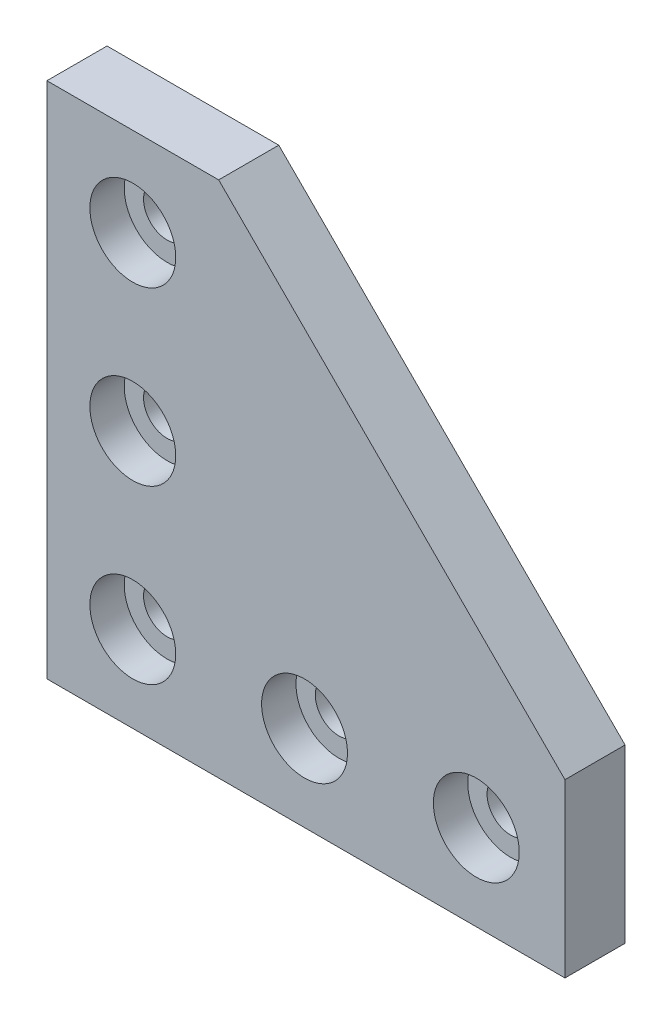
ISO-10303-21;
HEADER;
FILE_DESCRIPTION(('STEP AP214'),'2;1');
FILE_NAME('part.step','',(''),(''),'','','');
FILE_SCHEMA(('AUTOMOTIVE_DESIGN { 1 0 10303 214 1 1 1 1 }'));
ENDSEC;
DATA;
#1=APPLICATION_CONTEXT('core data for automotive mechanical design processes');
#2=APPLICATION_PROTOCOL_DEFINITION('international standard','automotive_design',2000,#1);
#3=PRODUCT_CONTEXT('',#1,'mechanical');
#4=PRODUCT('Part','Part','',(#3));
#5=PRODUCT_RELATED_PRODUCT_CATEGORY('part','',(#4));
#6=PRODUCT_DEFINITION_FORMATION('','',#4);
#7=PRODUCT_DEFINITION_CONTEXT('part definition',#1,'design');
#8=PRODUCT_DEFINITION('design','',#6,#7);
#9=PRODUCT_DEFINITION_SHAPE('','',#8);
#10=(LENGTH_UNIT() NAMED_UNIT(*) SI_UNIT(.MILLI.,.METRE.));
#11=(NAMED_UNIT(*) PLANE_ANGLE_UNIT() SI_UNIT($,.RADIAN.));
#12=(NAMED_UNIT(*) SI_UNIT($,.STERADIAN.) SOLID_ANGLE_UNIT());
#13=UNCERTAINTY_MEASURE_WITH_UNIT(LENGTH_MEASURE(1.E-05),#10,'distance_accuracy_value','');
#14=(GEOMETRIC_REPRESENTATION_CONTEXT(3) GLOBAL_UNCERTAINTY_ASSIGNED_CONTEXT((#13)) GLOBAL_UNIT_ASSIGNED_CONTEXT((#10,
#11,#12)) REPRESENTATION_CONTEXT('',''));
#15=CARTESIAN_POINT('',(0.,0.,0.));
#16=DIRECTION('',(0.,0.,1.));
#17=DIRECTION('',(1.,0.,0.));
#18=AXIS2_PLACEMENT_3D('',#15,#16,#17);
#19=CARTESIAN_POINT('',(30.1625,30.1625,0.));
#20=DIRECTION('',(0.,0.,1.));
#21=DIRECTION('',(1.,0.,0.));
#22=AXIS2_PLACEMENT_3D('',#19,#20,#21);
#23=PLANE('',#22);
#24=CARTESIAN_POINT('',(10.,10.,0.));
#25=DIRECTION('',(0.,0.,-1.));
#26=DIRECTION('',(-1.,0.,0.));
#27=AXIS2_PLACEMENT_3D('',#24,#25,#26);
#28=CIRCLE('',#27,2.75);
#29=CARTESIAN_POINT('',(12.75,10.,0.));
#30=VERTEX_POINT('',#29);
#31=EDGE_CURVE('E414',#30,#30,#28,.T.);
#32=ORIENTED_EDGE('',*,*,#31,.F.);
#33=EDGE_LOOP('',(#32));
#34=FACE_BOUND('',#33,.T.);
#35=CARTESIAN_POINT('',(10.,30.,0.));
#36=DIRECTION('',(0.,0.,-1.));
#37=DIRECTION('',(-1.,0.,0.));
#38=AXIS2_PLACEMENT_3D('',#35,#36,#37);
#39=CIRCLE('',#38,2.75);
#40=CARTESIAN_POINT('',(12.75,30.,0.));
#41=VERTEX_POINT('',#40);
#42=EDGE_CURVE('E227',#41,#41,#39,.T.);
#43=ORIENTED_EDGE('',*,*,#42,.F.);
#44=EDGE_LOOP('',(#43));
#45=FACE_BOUND('',#44,.T.);
#46=CARTESIAN_POINT('',(10.,50.,0.));
#47=DIRECTION('',(0.,0.,-1.));
#48=DIRECTION('',(-1.,0.,0.));
#49=AXIS2_PLACEMENT_3D('',#46,#47,#48);
#50=CIRCLE('',#49,2.75);
#51=CARTESIAN_POINT('',(12.75,50.,0.));
#52=VERTEX_POINT('',#51);
#53=EDGE_CURVE('E226',#52,#52,#50,.T.);
#54=ORIENTED_EDGE('',*,*,#53,.F.);
#55=EDGE_LOOP('',(#54));
#56=FACE_BOUND('',#55,.T.);
#57=CARTESIAN_POINT('',(30.,10.,0.));
#58=DIRECTION('',(0.,0.,-1.));
#59=DIRECTION('',(-1.,0.,0.));
#60=AXIS2_PLACEMENT_3D('',#57,#58,#59);
#61=CIRCLE('',#60,2.75);
#62=CARTESIAN_POINT('',(32.75,10.,0.));
#63=VERTEX_POINT('',#62);
#64=EDGE_CURVE('E217',#63,#63,#61,.T.);
#65=ORIENTED_EDGE('',*,*,#64,.F.);
#66=EDGE_LOOP('',(#65));
#67=FACE_BOUND('',#66,.T.);
#68=CARTESIAN_POINT('',(50.,10.,0.));
#69=DIRECTION('',(0.,0.,-1.));
#70=DIRECTION('',(-1.,0.,0.));
#71=AXIS2_PLACEMENT_3D('',#68,#69,#70);
#72=CIRCLE('',#71,2.75);
#73=CARTESIAN_POINT('',(52.75,10.,0.));
#74=VERTEX_POINT('',#73);
#75=EDGE_CURVE('E187',#74,#74,#72,.T.);
#76=ORIENTED_EDGE('',*,*,#75,.F.);
#77=EDGE_LOOP('',(#76));
#78=FACE_BOUND('',#77,.T.);
#79=DIRECTION('',(1.,0.,0.));
#80=VECTOR('',#79,1.);
#81=CARTESIAN_POINT('',(0.,0.,0.));
#82=LINE('',#81,#80);
#83=CARTESIAN_POINT('',(0.,0.,0.));
#84=VERTEX_POINT('',#83);
#85=CARTESIAN_POINT('',(60.325,0.,0.));
#86=VERTEX_POINT('',#85);
#87=EDGE_CURVE('E27',#84,#86,#82,.T.);
#88=ORIENTED_EDGE('',*,*,#87,.F.);
#89=DIRECTION('',(0.,-1.,0.));
#90=VECTOR('',#89,1.);
#91=CARTESIAN_POINT('',(0.,60.325,0.));
#92=LINE('',#91,#90);
#93=CARTESIAN_POINT('',(0.,60.325,0.));
#94=VERTEX_POINT('',#93);
#95=EDGE_CURVE('E20',#94,#84,#92,.T.);
#96=ORIENTED_EDGE('',*,*,#95,.F.);
#97=DIRECTION('',(-1.,0.,0.));
#98=VECTOR('',#97,1.);
#99=CARTESIAN_POINT('',(20.,60.325,0.));
#100=LINE('',#99,#98);
#101=CARTESIAN_POINT('',(20.,60.325,0.));
#102=VERTEX_POINT('',#101);
#103=EDGE_CURVE('E194',#102,#94,#100,.T.);
#104=ORIENTED_EDGE('',*,*,#103,.F.);
#105=DIRECTION('',(-0.707106781186548,0.707106781186548,0.));
#106=VECTOR('',#105,1.);
#107=CARTESIAN_POINT('',(60.325,20.,0.));
#108=LINE('',#107,#106);
#109=CARTESIAN_POINT('',(60.325,20.,0.));
#110=VERTEX_POINT('',#109);
#111=EDGE_CURVE('E270',#110,#102,#108,.T.);
#112=ORIENTED_EDGE('',*,*,#111,.F.);
#113=DIRECTION('',(0.,1.,0.));
#114=VECTOR('',#113,1.);
#115=CARTESIAN_POINT('',(60.325,0.,0.));
#116=LINE('',#115,#114);
#117=EDGE_CURVE('E260',#86,#110,#116,.T.);
#118=ORIENTED_EDGE('',*,*,#117,.F.);
#119=EDGE_LOOP('',(#88,#96,#104,#112,#118));
#120=FACE_BOUND('',#119,.T.);
#121=ADVANCED_FACE('F16',(#34,#45,#56,#67,#78,#120),#23,.F.);
#122=CARTESIAN_POINT('',(30.1625,30.1625,7.));
#123=DIRECTION('',(0.,0.,1.));
#124=DIRECTION('',(1.,0.,0.));
#125=AXIS2_PLACEMENT_3D('',#122,#123,#124);
#126=PLANE('',#125);
#127=DIRECTION('',(-1.,0.,0.));
#128=VECTOR('',#127,1.);
#129=CARTESIAN_POINT('',(0.,0.,7.));
#130=LINE('',#129,#128);
#131=CARTESIAN_POINT('',(60.325,0.,7.));
#132=VERTEX_POINT('',#131);
#133=CARTESIAN_POINT('',(0.,0.,7.));
#134=VERTEX_POINT('',#133);
#135=EDGE_CURVE('E11',#132,#134,#130,.T.);
#136=ORIENTED_EDGE('',*,*,#135,.F.);
#137=DIRECTION('',(0.,-1.,0.));
#138=VECTOR('',#137,1.);
#139=CARTESIAN_POINT('',(60.325,0.,7.));
#140=LINE('',#139,#138);
#141=CARTESIAN_POINT('',(60.325,20.,7.));
#142=VERTEX_POINT('',#141);
#143=EDGE_CURVE('E212',#142,#132,#140,.T.);
#144=ORIENTED_EDGE('',*,*,#143,.F.);
#145=DIRECTION('',(0.707106781186548,-0.707106781186548,0.));
#146=VECTOR('',#145,1.);
#147=CARTESIAN_POINT('',(60.325,20.,7.));
#148=LINE('',#147,#146);
#149=CARTESIAN_POINT('',(20.,60.325,7.));
#150=VERTEX_POINT('',#149);
#151=EDGE_CURVE('E261',#150,#142,#148,.T.);
#152=ORIENTED_EDGE('',*,*,#151,.F.);
#153=DIRECTION('',(1.,0.,0.));
#154=VECTOR('',#153,1.);
#155=CARTESIAN_POINT('',(20.,60.325,7.));
#156=LINE('',#155,#154);
#157=CARTESIAN_POINT('',(0.,60.325,7.));
#158=VERTEX_POINT('',#157);
#159=EDGE_CURVE('E174',#158,#150,#156,.T.);
#160=ORIENTED_EDGE('',*,*,#159,.F.);
#161=DIRECTION('',(0.,1.,0.));
#162=VECTOR('',#161,1.);
#163=CARTESIAN_POINT('',(0.,60.325,7.));
#164=LINE('',#163,#162);
#165=EDGE_CURVE('E170',#134,#158,#164,.T.);
#166=ORIENTED_EDGE('',*,*,#165,.F.);
#167=EDGE_LOOP('',(#136,#144,#152,#160,#166));
#168=FACE_BOUND('',#167,.T.);
#169=CARTESIAN_POINT('',(10.,50.,7.));
#170=DIRECTION('',(0.,0.,1.));
#171=DIRECTION('',(1.,0.,0.));
#172=AXIS2_PLACEMENT_3D('',#169,#170,#171);
#173=CIRCLE('',#172,5.);
#174=CARTESIAN_POINT('',(15.,50.,7.));
#175=VERTEX_POINT('',#174);
#176=EDGE_CURVE('E437',#175,#175,#173,.T.);
#177=ORIENTED_EDGE('',*,*,#176,.F.);
#178=EDGE_LOOP('',(#177));
#179=FACE_BOUND('',#178,.T.);
#180=CARTESIAN_POINT('',(50.,10.,7.));
#181=DIRECTION('',(0.,0.,1.));
#182=DIRECTION('',(1.,0.,0.));
#183=AXIS2_PLACEMENT_3D('',#180,#181,#182);
#184=CIRCLE('',#183,5.);
#185=CARTESIAN_POINT('',(55.,10.,7.));
#186=VERTEX_POINT('',#185);
#187=EDGE_CURVE('E388',#186,#186,#184,.T.);
#188=ORIENTED_EDGE('',*,*,#187,.F.);
#189=EDGE_LOOP('',(#188));
#190=FACE_BOUND('',#189,.T.);
#191=CARTESIAN_POINT('',(10.,30.,7.));
#192=DIRECTION('',(0.,0.,1.));
#193=DIRECTION('',(1.,0.,0.));
#194=AXIS2_PLACEMENT_3D('',#191,#192,#193);
#195=CIRCLE('',#194,5.);
#196=CARTESIAN_POINT('',(15.,30.,7.));
#197=VERTEX_POINT('',#196);
#198=EDGE_CURVE('E244',#197,#197,#195,.T.);
#199=ORIENTED_EDGE('',*,*,#198,.F.);
#200=EDGE_LOOP('',(#199));
#201=FACE_BOUND('',#200,.T.);
#202=CARTESIAN_POINT('',(30.,10.,7.));
#203=DIRECTION('',(0.,0.,1.));
#204=DIRECTION('',(1.,0.,0.));
#205=AXIS2_PLACEMENT_3D('',#202,#203,#204);
#206=CIRCLE('',#205,5.);
#207=CARTESIAN_POINT('',(35.,10.,7.));
#208=VERTEX_POINT('',#207);
#209=EDGE_CURVE('E370',#208,#208,#206,.T.);
#210=ORIENTED_EDGE('',*,*,#209,.F.);
#211=EDGE_LOOP('',(#210));
#212=FACE_BOUND('',#211,.T.);
#213=CARTESIAN_POINT('',(10.,10.,7.));
#214=DIRECTION('',(0.,0.,1.));
#215=DIRECTION('',(1.,0.,0.));
#216=AXIS2_PLACEMENT_3D('',#213,#214,#215);
#217=CIRCLE('',#216,5.);
#218=CARTESIAN_POINT('',(15.,10.,7.));
#219=VERTEX_POINT('',#218);
#220=EDGE_CURVE('E442',#219,#219,#217,.T.);
#221=ORIENTED_EDGE('',*,*,#220,.F.);
#222=EDGE_LOOP('',(#221));
#223=FACE_BOUND('',#222,.T.);
#224=ADVANCED_FACE('F171',(#168,#179,#190,#201,#212,#223),#126,.T.);
#225=CARTESIAN_POINT('',(0.,0.,0.));
#226=DIRECTION('',(0.,-1.,0.));
#227=DIRECTION('',(0.,0.,-1.));
#228=AXIS2_PLACEMENT_3D('',#225,#226,#227);
#229=PLANE('',#228);
#230=ORIENTED_EDGE('',*,*,#87,.T.);
#231=DIRECTION('',(0.,0.,-1.));
#232=VECTOR('',#231,1.);
#233=CARTESIAN_POINT('',(60.325,0.,0.));
#234=LINE('',#233,#232);
#235=EDGE_CURVE('E167',#132,#86,#234,.T.);
#236=ORIENTED_EDGE('',*,*,#235,.F.);
#237=ORIENTED_EDGE('',*,*,#135,.T.);
#238=DIRECTION('',(0.,0.,1.));
#239=VECTOR('',#238,1.);
#240=CARTESIAN_POINT('',(0.,0.,0.));
#241=LINE('',#240,#239);
#242=EDGE_CURVE('E164',#84,#134,#241,.T.);
#243=ORIENTED_EDGE('',*,*,#242,.F.);
#244=EDGE_LOOP('',(#230,#236,#237,#243));
#245=FACE_BOUND('',#244,.T.);
#246=ADVANCED_FACE('F162',(#245),#229,.T.);
#247=CARTESIAN_POINT('',(60.325,0.,0.));
#248=DIRECTION('',(1.,0.,0.));
#249=DIRECTION('',(0.,1.,0.));
#250=AXIS2_PLACEMENT_3D('',#247,#248,#249);
#251=PLANE('',#250);
#252=ORIENTED_EDGE('',*,*,#117,.T.);
#253=DIRECTION('',(0.,0.,-1.));
#254=VECTOR('',#253,1.);
#255=CARTESIAN_POINT('',(60.325,20.,0.));
#256=LINE('',#255,#254);
#257=EDGE_CURVE('E254',#142,#110,#256,.T.);
#258=ORIENTED_EDGE('',*,*,#257,.F.);
#259=ORIENTED_EDGE('',*,*,#143,.T.);
#260=ORIENTED_EDGE('',*,*,#235,.T.);
#261=EDGE_LOOP('',(#252,#258,#259,#260));
#262=FACE_BOUND('',#261,.T.);
#263=ADVANCED_FACE('F280',(#262),#251,.T.);
#264=CARTESIAN_POINT('',(60.325,20.,0.));
#265=DIRECTION('',(0.707106781186548,0.707106781186548,0.));
#266=DIRECTION('',(0.,0.,-1.));
#267=AXIS2_PLACEMENT_3D('',#264,#265,#266);
#268=PLANE('',#267);
#269=ORIENTED_EDGE('',*,*,#111,.T.);
#270=DIRECTION('',(0.,0.,-1.));
#271=VECTOR('',#270,1.);
#272=CARTESIAN_POINT('',(20.,60.325,0.));
#273=LINE('',#272,#271);
#274=EDGE_CURVE('E205',#150,#102,#273,.T.);
#275=ORIENTED_EDGE('',*,*,#274,.F.);
#276=ORIENTED_EDGE('',*,*,#151,.T.);
#277=ORIENTED_EDGE('',*,*,#257,.T.);
#278=EDGE_LOOP('',(#269,#275,#276,#277));
#279=FACE_BOUND('',#278,.T.);
#280=ADVANCED_FACE('F285',(#279),#268,.T.);
#281=CARTESIAN_POINT('',(20.,60.325,0.));
#282=DIRECTION('',(0.,1.,0.));
#283=DIRECTION('',(1.,0.,0.));
#284=AXIS2_PLACEMENT_3D('',#281,#282,#283);
#285=PLANE('',#284);
#286=ORIENTED_EDGE('',*,*,#103,.T.);
#287=DIRECTION('',(0.,0.,-1.));
#288=VECTOR('',#287,1.);
#289=CARTESIAN_POINT('',(0.,60.325,0.));
#290=LINE('',#289,#288);
#291=EDGE_CURVE('E179',#158,#94,#290,.T.);
#292=ORIENTED_EDGE('',*,*,#291,.F.);
#293=ORIENTED_EDGE('',*,*,#159,.T.);
#294=ORIENTED_EDGE('',*,*,#274,.T.);
#295=EDGE_LOOP('',(#286,#292,#293,#294));
#296=FACE_BOUND('',#295,.T.);
#297=ADVANCED_FACE('F288',(#296),#285,.T.);
#298=CARTESIAN_POINT('',(0.,60.325,0.));
#299=DIRECTION('',(-1.,0.,0.));
#300=DIRECTION('',(0.,0.,1.));
#301=AXIS2_PLACEMENT_3D('',#298,#299,#300);
#302=PLANE('',#301);
#303=ORIENTED_EDGE('',*,*,#95,.T.);
#304=ORIENTED_EDGE('',*,*,#242,.T.);
#305=ORIENTED_EDGE('',*,*,#165,.T.);
#306=ORIENTED_EDGE('',*,*,#291,.T.);
#307=EDGE_LOOP('',(#303,#304,#305,#306));
#308=FACE_BOUND('',#307,.T.);
#309=ADVANCED_FACE('F18',(#308),#302,.T.);
#310=CARTESIAN_POINT('',(50.,10.,0.));
#311=DIRECTION('',(0.,0.,1.));
#312=DIRECTION('',(-1.,0.,0.));
#313=AXIS2_PLACEMENT_3D('',#310,#311,#312);
#314=CYLINDRICAL_SURFACE('',#313,2.75);
#315=CARTESIAN_POINT('',(52.75,10.,0.));
#316=CARTESIAN_POINT('',(52.75,10.,3.));
#317=(BOUNDED_CURVE() B_SPLINE_CURVE(1,(#315,#316),.UNSPECIFIED.,.F.,
.F.) B_SPLINE_CURVE_WITH_KNOTS((2,2),(0.,3.),
.UNSPECIFIED.) CURVE() GEOMETRIC_REPRESENTATION_ITEM() RATIONAL_B_SPLINE_CURVE((1.,1.)) REPRESENTATION_ITEM(''));
#318=CARTESIAN_POINT('',(52.75,10.,3.));
#319=VERTEX_POINT('',#318);
#320=EDGE_CURVE('E60',#74,#319,#317,.T.);
#321=ORIENTED_EDGE('',*,*,#320,.F.);
#322=ORIENTED_EDGE('',*,*,#75,.T.);
#323=ORIENTED_EDGE('',*,*,#320,.T.);
#324=CARTESIAN_POINT('',(50.,10.,3.));
#325=DIRECTION('',(0.,0.,-1.));
#326=DIRECTION('',(-1.,0.,0.));
#327=AXIS2_PLACEMENT_3D('',#324,#325,#326);
#328=CIRCLE('',#327,2.75);
#329=EDGE_CURVE('E396',#319,#319,#328,.T.);
#330=ORIENTED_EDGE('',*,*,#329,.F.);
#331=EDGE_LOOP('',(#321,#322,#323,#330));
#332=FACE_BOUND('',#331,.T.);
#333=ADVANCED_FACE('F296',(#332),#314,.F.);
#334=CARTESIAN_POINT('',(30.,10.,0.));
#335=DIRECTION('',(0.,0.,1.));
#336=DIRECTION('',(-1.,0.,0.));
#337=AXIS2_PLACEMENT_3D('',#334,#335,#336);
#338=CYLINDRICAL_SURFACE('',#337,2.75);
#339=CARTESIAN_POINT('',(32.75,10.,0.));
#340=CARTESIAN_POINT('',(32.75,10.,3.));
#341=(BOUNDED_CURVE() B_SPLINE_CURVE(1,(#339,#340),.UNSPECIFIED.,.F.,
.F.) B_SPLINE_CURVE_WITH_KNOTS((2,2),(0.,3.),
.UNSPECIFIED.) CURVE() GEOMETRIC_REPRESENTATION_ITEM() RATIONAL_B_SPLINE_CURVE((1.,1.)) REPRESENTATION_ITEM(''));
#342=CARTESIAN_POINT('',(32.75,10.,3.));
#343=VERTEX_POINT('',#342);
#344=EDGE_CURVE('E250',#63,#343,#341,.T.);
#345=ORIENTED_EDGE('',*,*,#344,.F.);
#346=ORIENTED_EDGE('',*,*,#64,.T.);
#347=ORIENTED_EDGE('',*,*,#344,.T.);
#348=CARTESIAN_POINT('',(30.,10.,3.));
#349=DIRECTION('',(0.,0.,-1.));
#350=DIRECTION('',(-1.,0.,0.));
#351=AXIS2_PLACEMENT_3D('',#348,#349,#350);
#352=CIRCLE('',#351,2.75);
#353=EDGE_CURVE('E233',#343,#343,#352,.T.);
#354=ORIENTED_EDGE('',*,*,#353,.F.);
#355=EDGE_LOOP('',(#345,#346,#347,#354));
#356=FACE_BOUND('',#355,.T.);
#357=ADVANCED_FACE('F334',(#356),#338,.F.);
#358=CARTESIAN_POINT('',(10.,50.,0.));
#359=DIRECTION('',(0.,0.,1.));
#360=DIRECTION('',(-1.,0.,0.));
#361=AXIS2_PLACEMENT_3D('',#358,#359,#360);
#362=CYLINDRICAL_SURFACE('',#361,2.75);
#363=CARTESIAN_POINT('',(12.75,50.,0.));
#364=CARTESIAN_POINT('',(12.75,50.,3.));
#365=(BOUNDED_CURVE() B_SPLINE_CURVE(1,(#363,#364),.UNSPECIFIED.,.F.,
.F.) B_SPLINE_CURVE_WITH_KNOTS((2,2),(0.,3.),
.UNSPECIFIED.) CURVE() GEOMETRIC_REPRESENTATION_ITEM() RATIONAL_B_SPLINE_CURVE((1.,1.)) REPRESENTATION_ITEM(''));
#366=CARTESIAN_POINT('',(12.75,50.,3.));
#367=VERTEX_POINT('',#366);
#368=EDGE_CURVE('E218',#52,#367,#365,.T.);
#369=ORIENTED_EDGE('',*,*,#368,.F.);
#370=ORIENTED_EDGE('',*,*,#53,.T.);
#371=ORIENTED_EDGE('',*,*,#368,.T.);
#372=CARTESIAN_POINT('',(10.,50.,3.));
#373=DIRECTION('',(0.,0.,-1.));
#374=DIRECTION('',(-1.,0.,0.));
#375=AXIS2_PLACEMENT_3D('',#372,#373,#374);
#376=CIRCLE('',#375,2.75);
#377=EDGE_CURVE('E209',#367,#367,#376,.T.);
#378=ORIENTED_EDGE('',*,*,#377,.F.);
#379=EDGE_LOOP('',(#369,#370,#371,#378));
#380=FACE_BOUND('',#379,.T.);
#381=ADVANCED_FACE('F328',(#380),#362,.F.);
#382=CARTESIAN_POINT('',(10.,30.,0.));
#383=DIRECTION('',(0.,0.,1.));
#384=DIRECTION('',(-1.,0.,0.));
#385=AXIS2_PLACEMENT_3D('',#382,#383,#384);
#386=CYLINDRICAL_SURFACE('',#385,2.75);
#387=CARTESIAN_POINT('',(12.75,30.,0.));
#388=CARTESIAN_POINT('',(12.75,30.,3.));
#389=(BOUNDED_CURVE() B_SPLINE_CURVE(1,(#387,#388),.UNSPECIFIED.,.F.,
.F.) B_SPLINE_CURVE_WITH_KNOTS((2,2),(0.,3.),
.UNSPECIFIED.) CURVE() GEOMETRIC_REPRESENTATION_ITEM() RATIONAL_B_SPLINE_CURVE((1.,1.)) REPRESENTATION_ITEM(''));
#390=CARTESIAN_POINT('',(12.75,30.,3.));
#391=VERTEX_POINT('',#390);
#392=EDGE_CURVE('E419',#41,#391,#389,.T.);
#393=ORIENTED_EDGE('',*,*,#392,.F.);
#394=ORIENTED_EDGE('',*,*,#42,.T.);
#395=ORIENTED_EDGE('',*,*,#392,.T.);
#396=CARTESIAN_POINT('',(10.,30.,3.));
#397=DIRECTION('',(0.,0.,-1.));
#398=DIRECTION('',(-1.,0.,0.));
#399=AXIS2_PLACEMENT_3D('',#396,#397,#398);
#400=CIRCLE('',#399,2.75);
#401=EDGE_CURVE('E355',#391,#391,#400,.T.);
#402=ORIENTED_EDGE('',*,*,#401,.F.);
#403=EDGE_LOOP('',(#393,#394,#395,#402));
#404=FACE_BOUND('',#403,.T.);
#405=ADVANCED_FACE('F316',(#404),#386,.F.);
#406=CARTESIAN_POINT('',(10.,10.,0.));
#407=DIRECTION('',(0.,0.,1.));
#408=DIRECTION('',(-1.,0.,0.));
#409=AXIS2_PLACEMENT_3D('',#406,#407,#408);
#410=CYLINDRICAL_SURFACE('',#409,2.75);
#411=CARTESIAN_POINT('',(12.75,10.,0.));
#412=CARTESIAN_POINT('',(12.75,10.,3.));
#413=(BOUNDED_CURVE() B_SPLINE_CURVE(1,(#411,#412),.UNSPECIFIED.,.F.,
.F.) B_SPLINE_CURVE_WITH_KNOTS((2,2),(0.,3.),
.UNSPECIFIED.) CURVE() GEOMETRIC_REPRESENTATION_ITEM() RATIONAL_B_SPLINE_CURVE((1.,1.)) REPRESENTATION_ITEM(''));
#414=CARTESIAN_POINT('',(12.75,10.,3.));
#415=VERTEX_POINT('',#414);
#416=EDGE_CURVE('E407',#30,#415,#413,.T.);
#417=ORIENTED_EDGE('',*,*,#416,.F.);
#418=ORIENTED_EDGE('',*,*,#31,.T.);
#419=ORIENTED_EDGE('',*,*,#416,.T.);
#420=CARTESIAN_POINT('',(10.,10.,3.));
#421=DIRECTION('',(0.,0.,-1.));
#422=DIRECTION('',(-1.,0.,0.));
#423=AXIS2_PLACEMENT_3D('',#420,#421,#422);
#424=CIRCLE('',#423,2.75);
#425=EDGE_CURVE('E367',#415,#415,#424,.T.);
#426=ORIENTED_EDGE('',*,*,#425,.F.);
#427=EDGE_LOOP('',(#417,#418,#419,#426));
#428=FACE_BOUND('',#427,.T.);
#429=ADVANCED_FACE('F312',(#428),#410,.F.);
#430=CARTESIAN_POINT('',(10.,50.,3.));
#431=DIRECTION('',(0.,0.,1.));
#432=DIRECTION('',(1.,0.,0.));
#433=AXIS2_PLACEMENT_3D('',#430,#431,#432);
#434=PLANE('',#433);
#435=ORIENTED_EDGE('',*,*,#377,.T.);
#436=EDGE_LOOP('',(#435));
#437=FACE_BOUND('',#436,.T.);
#438=CARTESIAN_POINT('',(10.,50.,3.));
#439=DIRECTION('',(0.,0.,-1.));
#440=DIRECTION('',(1.,0.,0.));
#441=AXIS2_PLACEMENT_3D('',#438,#439,#440);
#442=CIRCLE('',#441,5.);
#443=CARTESIAN_POINT('',(15.,50.,3.));
#444=VERTEX_POINT('',#443);
#445=EDGE_CURVE('E459',#444,#444,#442,.T.);
#446=ORIENTED_EDGE('',*,*,#445,.F.);
#447=EDGE_LOOP('',(#446));
#448=FACE_BOUND('',#447,.T.);
#449=ADVANCED_FACE('F315',(#437,#448),#434,.T.);
#450=CARTESIAN_POINT('',(10.,50.,7.));
#451=DIRECTION('',(0.,0.,-1.));
#452=DIRECTION('',(1.,0.,0.));
#453=AXIS2_PLACEMENT_3D('',#450,#451,#452);
#454=CYLINDRICAL_SURFACE('',#453,5.);
#455=CARTESIAN_POINT('',(15.,50.,7.));
#456=CARTESIAN_POINT('',(15.,50.,3.));
#457=(BOUNDED_CURVE() B_SPLINE_CURVE(1,(#455,#456),.UNSPECIFIED.,.F.,
.F.) B_SPLINE_CURVE_WITH_KNOTS((2,2),(0.,4.),
.UNSPECIFIED.) CURVE() GEOMETRIC_REPRESENTATION_ITEM() RATIONAL_B_SPLINE_CURVE((1.,1.)) REPRESENTATION_ITEM(''));
#458=EDGE_CURVE('E189',#175,#444,#457,.T.);
#459=ORIENTED_EDGE('',*,*,#458,.F.);
#460=ORIENTED_EDGE('',*,*,#176,.T.);
#461=ORIENTED_EDGE('',*,*,#458,.T.);
#462=ORIENTED_EDGE('',*,*,#445,.T.);
#463=EDGE_LOOP('',(#459,#460,#461,#462));
#464=FACE_BOUND('',#463,.T.);
#465=ADVANCED_FACE('F323',(#464),#454,.F.);
#466=CARTESIAN_POINT('',(50.,10.,3.));
#467=DIRECTION('',(0.,0.,1.));
#468=DIRECTION('',(1.,0.,0.));
#469=AXIS2_PLACEMENT_3D('',#466,#467,#468);
#470=PLANE('',#469);
#471=ORIENTED_EDGE('',*,*,#329,.T.);
#472=EDGE_LOOP('',(#471));
#473=FACE_BOUND('',#472,.T.);
#474=CARTESIAN_POINT('',(50.,10.,3.));
#475=DIRECTION('',(0.,0.,-1.));
#476=DIRECTION('',(1.,0.,0.));
#477=AXIS2_PLACEMENT_3D('',#474,#475,#476);
#478=CIRCLE('',#477,5.);
#479=CARTESIAN_POINT('',(55.,10.,3.));
#480=VERTEX_POINT('',#479);
#481=EDGE_CURVE('E77',#480,#480,#478,.T.);
#482=ORIENTED_EDGE('',*,*,#481,.F.);
#483=EDGE_LOOP('',(#482));
#484=FACE_BOUND('',#483,.T.);
#485=ADVANCED_FACE('F322',(#473,#484),#470,.T.);
#486=CARTESIAN_POINT('',(50.,10.,7.));
#487=DIRECTION('',(0.,0.,-1.));
#488=DIRECTION('',(1.,0.,0.));
#489=AXIS2_PLACEMENT_3D('',#486,#487,#488);
#490=CYLINDRICAL_SURFACE('',#489,5.);
#491=CARTESIAN_POINT('',(55.,10.,7.));
#492=CARTESIAN_POINT('',(55.,10.,3.));
#493=(BOUNDED_CURVE() B_SPLINE_CURVE(1,(#491,#492),.UNSPECIFIED.,.F.,
.F.) B_SPLINE_CURVE_WITH_KNOTS((2,2),(0.,4.),
.UNSPECIFIED.) CURVE() GEOMETRIC_REPRESENTATION_ITEM() RATIONAL_B_SPLINE_CURVE((1.,1.)) REPRESENTATION_ITEM(''));
#494=EDGE_CURVE('E362',#186,#480,#493,.T.);
#495=ORIENTED_EDGE('',*,*,#494,.F.);
#496=ORIENTED_EDGE('',*,*,#187,.T.);
#497=ORIENTED_EDGE('',*,*,#494,.T.);
#498=ORIENTED_EDGE('',*,*,#481,.T.);
#499=EDGE_LOOP('',(#495,#496,#497,#498));
#500=FACE_BOUND('',#499,.T.);
#501=ADVANCED_FACE('F318',(#500),#490,.F.);
#502=CARTESIAN_POINT('',(10.,30.,3.));
#503=DIRECTION('',(0.,0.,1.));
#504=DIRECTION('',(1.,0.,0.));
#505=AXIS2_PLACEMENT_3D('',#502,#503,#504);
#506=PLANE('',#505);
#507=ORIENTED_EDGE('',*,*,#401,.T.);
#508=EDGE_LOOP('',(#507));
#509=FACE_BOUND('',#508,.T.);
#510=CARTESIAN_POINT('',(10.,30.,3.));
#511=DIRECTION('',(0.,0.,-1.));
#512=DIRECTION('',(1.,0.,0.));
#513=AXIS2_PLACEMENT_3D('',#510,#511,#512);
#514=CIRCLE('',#513,5.);
#515=CARTESIAN_POINT('',(15.,30.,3.));
#516=VERTEX_POINT('',#515);
#517=EDGE_CURVE('E352',#516,#516,#514,.T.);
#518=ORIENTED_EDGE('',*,*,#517,.F.);
#519=EDGE_LOOP('',(#518));
#520=FACE_BOUND('',#519,.T.);
#521=ADVANCED_FACE('F321',(#509,#520),#506,.T.);
#522=CARTESIAN_POINT('',(10.,30.,7.));
#523=DIRECTION('',(0.,0.,-1.));
#524=DIRECTION('',(1.,0.,0.));
#525=AXIS2_PLACEMENT_3D('',#522,#523,#524);
#526=CYLINDRICAL_SURFACE('',#525,5.);
#527=CARTESIAN_POINT('',(15.,30.,7.));
#528=CARTESIAN_POINT('',(15.,30.,3.));
#529=(BOUNDED_CURVE() B_SPLINE_CURVE(1,(#527,#528),.UNSPECIFIED.,.F.,
.F.) B_SPLINE_CURVE_WITH_KNOTS((2,2),(0.,4.),
.UNSPECIFIED.) CURVE() GEOMETRIC_REPRESENTATION_ITEM() RATIONAL_B_SPLINE_CURVE((1.,1.)) REPRESENTATION_ITEM(''));
#530=EDGE_CURVE('E237',#197,#516,#529,.T.);
#531=ORIENTED_EDGE('',*,*,#530,.F.);
#532=ORIENTED_EDGE('',*,*,#198,.T.);
#533=ORIENTED_EDGE('',*,*,#530,.T.);
#534=ORIENTED_EDGE('',*,*,#517,.T.);
#535=EDGE_LOOP('',(#531,#532,#533,#534));
#536=FACE_BOUND('',#535,.T.);
#537=ADVANCED_FACE('F336',(#536),#526,.F.);
#538=CARTESIAN_POINT('',(30.,10.,3.));
#539=DIRECTION('',(0.,0.,1.));
#540=DIRECTION('',(1.,0.,0.));
#541=AXIS2_PLACEMENT_3D('',#538,#539,#540);
#542=PLANE('',#541);
#543=CARTESIAN_POINT('',(30.,10.,3.));
#544=DIRECTION('',(0.,0.,-1.));
#545=DIRECTION('',(1.,0.,0.));
#546=AXIS2_PLACEMENT_3D('',#543,#544,#545);
#547=CIRCLE('',#546,5.);
#548=CARTESIAN_POINT('',(35.,10.,3.));
#549=VERTEX_POINT('',#548);
#550=EDGE_CURVE('E238',#549,#549,#547,.T.);
#551=ORIENTED_EDGE('',*,*,#550,.F.);
#552=EDGE_LOOP('',(#551));
#553=FACE_BOUND('',#552,.T.);
#554=ORIENTED_EDGE('',*,*,#353,.T.);
#555=EDGE_LOOP('',(#554));
#556=FACE_BOUND('',#555,.T.);
#557=ADVANCED_FACE('F338',(#553,#556),#542,.T.);
#558=CARTESIAN_POINT('',(30.,10.,7.));
#559=DIRECTION('',(0.,0.,-1.));
#560=DIRECTION('',(1.,0.,0.));
#561=AXIS2_PLACEMENT_3D('',#558,#559,#560);
#562=CYLINDRICAL_SURFACE('',#561,5.);
#563=CARTESIAN_POINT('',(35.,10.,7.));
#564=CARTESIAN_POINT('',(35.,10.,3.));
#565=(BOUNDED_CURVE() B_SPLINE_CURVE(1,(#563,#564),.UNSPECIFIED.,.F.,
.F.) B_SPLINE_CURVE_WITH_KNOTS((2,2),(0.,4.),
.UNSPECIFIED.) CURVE() GEOMETRIC_REPRESENTATION_ITEM() RATIONAL_B_SPLINE_CURVE((1.,1.)) REPRESENTATION_ITEM(''));
#566=EDGE_CURVE('E377',#208,#549,#565,.T.);
#567=ORIENTED_EDGE('',*,*,#566,.F.);
#568=ORIENTED_EDGE('',*,*,#209,.T.);
#569=ORIENTED_EDGE('',*,*,#566,.T.);
#570=ORIENTED_EDGE('',*,*,#550,.T.);
#571=EDGE_LOOP('',(#567,#568,#569,#570));
#572=FACE_BOUND('',#571,.T.);
#573=ADVANCED_FACE('F344',(#572),#562,.F.);
#574=CARTESIAN_POINT('',(10.,10.,3.));
#575=DIRECTION('',(0.,0.,1.));
#576=DIRECTION('',(1.,0.,0.));
#577=AXIS2_PLACEMENT_3D('',#574,#575,#576);
#578=PLANE('',#577);
#579=ORIENTED_EDGE('',*,*,#425,.T.);
#580=EDGE_LOOP('',(#579));
#581=FACE_BOUND('',#580,.T.);
#582=CARTESIAN_POINT('',(10.,10.,3.));
#583=DIRECTION('',(0.,0.,-1.));
#584=DIRECTION('',(1.,0.,0.));
#585=AXIS2_PLACEMENT_3D('',#582,#583,#584);
#586=CIRCLE('',#585,5.);
#587=CARTESIAN_POINT('',(15.,10.,3.));
#588=VERTEX_POINT('',#587);
#589=EDGE_CURVE('E402',#588,#588,#586,.T.);
#590=ORIENTED_EDGE('',*,*,#589,.F.);
#591=EDGE_LOOP('',(#590));
#592=FACE_BOUND('',#591,.T.);
#593=ADVANCED_FACE('F475',(#581,#592),#578,.T.);
#594=CARTESIAN_POINT('',(10.,10.,7.));
#595=DIRECTION('',(0.,0.,-1.));
#596=DIRECTION('',(1.,0.,0.));
#597=AXIS2_PLACEMENT_3D('',#594,#595,#596);
#598=CYLINDRICAL_SURFACE('',#597,5.);
#599=CARTESIAN_POINT('',(15.,10.,7.));
#600=CARTESIAN_POINT('',(15.,10.,3.));
#601=(BOUNDED_CURVE() B_SPLINE_CURVE(1,(#599,#600),.UNSPECIFIED.,.F.,
.F.) B_SPLINE_CURVE_WITH_KNOTS((2,2),(0.,4.),
.UNSPECIFIED.) CURVE() GEOMETRIC_REPRESENTATION_ITEM() RATIONAL_B_SPLINE_CURVE((1.,1.)) REPRESENTATION_ITEM(''));
#602=EDGE_CURVE('E444',#219,#588,#601,.T.);
#603=ORIENTED_EDGE('',*,*,#602,.F.);
#604=ORIENTED_EDGE('',*,*,#220,.T.);
#605=ORIENTED_EDGE('',*,*,#602,.T.);
#606=ORIENTED_EDGE('',*,*,#589,.T.);
#607=EDGE_LOOP('',(#603,#604,#605,#606));
#608=FACE_BOUND('',#607,.T.);
#609=ADVANCED_FACE('F310',(#608),#598,.F.);
#610=CLOSED_SHELL('',(#121,#224,#246,#263,#280,#297,#309,#333,#357,#381,#405,#429,#449,#465,
#485,#501,#521,#537,#557,#573,#593,#609));
#611=MANIFOLD_SOLID_BREP('B1',#610);
#612=ADVANCED_BREP_SHAPE_REPRESENTATION('',(#18,#611),#14);
#613=SHAPE_DEFINITION_REPRESENTATION(#9,#612);
ENDSEC;
END-ISO-10303-21;
